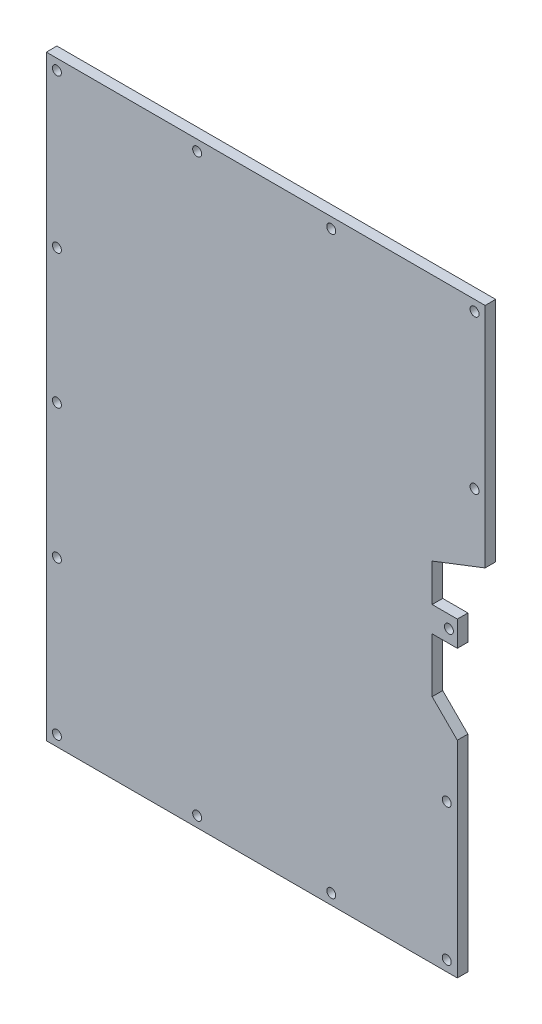
ISO-10303-21;
HEADER;
FILE_DESCRIPTION(('STEP AP214'),'2;1');
FILE_NAME('part.step','',(''),(''),'','','');
FILE_SCHEMA(('AUTOMOTIVE_DESIGN { 1 0 10303 214 1 1 1 1 }'));
ENDSEC;
DATA;
#1=APPLICATION_CONTEXT('core data for automotive mechanical design processes');
#2=APPLICATION_PROTOCOL_DEFINITION('international standard','automotive_design',2000,#1);
#3=PRODUCT_CONTEXT('',#1,'mechanical');
#4=PRODUCT('Part','Part','',(#3));
#5=PRODUCT_RELATED_PRODUCT_CATEGORY('part','',(#4));
#6=PRODUCT_DEFINITION_FORMATION('','',#4);
#7=PRODUCT_DEFINITION_CONTEXT('part definition',#1,'design');
#8=PRODUCT_DEFINITION('design','',#6,#7);
#9=PRODUCT_DEFINITION_SHAPE('','',#8);
#10=(LENGTH_UNIT() NAMED_UNIT(*) SI_UNIT(.MILLI.,.METRE.));
#11=(NAMED_UNIT(*) PLANE_ANGLE_UNIT() SI_UNIT($,.RADIAN.));
#12=(NAMED_UNIT(*) SI_UNIT($,.STERADIAN.) SOLID_ANGLE_UNIT());
#13=UNCERTAINTY_MEASURE_WITH_UNIT(LENGTH_MEASURE(1.E-05),#10,'distance_accuracy_value','');
#14=(GEOMETRIC_REPRESENTATION_CONTEXT(3) GLOBAL_UNCERTAINTY_ASSIGNED_CONTEXT((#13)) GLOBAL_UNIT_ASSIGNED_CONTEXT((#10,
#11,#12)) REPRESENTATION_CONTEXT('',''));
#15=CARTESIAN_POINT('',(0.,0.,0.));
#16=DIRECTION('',(0.,0.,1.));
#17=DIRECTION('',(1.,0.,0.));
#18=AXIS2_PLACEMENT_3D('',#15,#16,#17);
#19=CARTESIAN_POINT('',(-1.58749999999999,-56.4375,2.));
#20=DIRECTION('',(0.,0.,-1.));
#21=DIRECTION('',(-1.,0.,0.));
#22=AXIS2_PLACEMENT_3D('',#19,#20,#21);
#23=PLANE('',#22);
#24=CARTESIAN_POINT('',(-3.58749999999999,-28.51830741,2.));
#25=DIRECTION('',(0.,0.,1.));
#26=DIRECTION('',(1.,0.,0.));
#27=AXIS2_PLACEMENT_3D('',#24,#25,#26);
#28=CIRCLE('',#27,0.85);
#29=CARTESIAN_POINT('',(-2.73749999999999,-28.51830741,2.));
#30=VERTEX_POINT('',#29);
#31=EDGE_CURVE('E332',#30,#30,#28,.T.);
#32=ORIENTED_EDGE('',*,*,#31,.F.);
#33=EDGE_LOOP('',(#32));
#34=FACE_BOUND('',#33,.T.);
#35=CARTESIAN_POINT('',(-25.4438331206112,-54.4375,2.));
#36=DIRECTION('',(0.,0.,1.));
#37=DIRECTION('',(1.,0.,0.));
#38=AXIS2_PLACEMENT_3D('',#35,#36,#37);
#39=CIRCLE('',#38,0.850000000000001);
#40=CARTESIAN_POINT('',(-24.5938331206112,-54.4375,2.));
#41=VERTEX_POINT('',#40);
#42=EDGE_CURVE('E344',#41,#41,#39,.T.);
#43=ORIENTED_EDGE('',*,*,#42,.F.);
#44=EDGE_LOOP('',(#43));
#45=FACE_BOUND('',#44,.T.);
#46=CARTESIAN_POINT('',(-77.375,-54.4375,2.));
#47=DIRECTION('',(0.,0.,1.));
#48=DIRECTION('',(1.,0.,0.));
#49=AXIS2_PLACEMENT_3D('',#46,#47,#48);
#50=CIRCLE('',#49,0.850000000000007);
#51=CARTESIAN_POINT('',(-76.525,-54.4375,2.));
#52=VERTEX_POINT('',#51);
#53=EDGE_CURVE('E356',#52,#52,#50,.T.);
#54=ORIENTED_EDGE('',*,*,#53,.F.);
#55=EDGE_LOOP('',(#54));
#56=FACE_BOUND('',#55,.T.);
#57=CARTESIAN_POINT('',(-77.375,0.,2.));
#58=DIRECTION('',(0.,0.,1.));
#59=DIRECTION('',(1.,0.,0.));
#60=AXIS2_PLACEMENT_3D('',#57,#58,#59);
#61=CIRCLE('',#60,0.850000000000007);
#62=CARTESIAN_POINT('',(-76.525,0.,2.));
#63=VERTEX_POINT('',#62);
#64=EDGE_CURVE('E368',#63,#63,#61,.T.);
#65=ORIENTED_EDGE('',*,*,#64,.F.);
#66=EDGE_LOOP('',(#65));
#67=FACE_BOUND('',#66,.T.);
#68=CARTESIAN_POINT('',(-77.375,54.4375,2.));
#69=DIRECTION('',(0.,0.,1.));
#70=DIRECTION('',(1.,0.,0.));
#71=AXIS2_PLACEMENT_3D('',#68,#69,#70);
#72=CIRCLE('',#71,0.850000000000007);
#73=CARTESIAN_POINT('',(-76.525,54.4375,2.));
#74=VERTEX_POINT('',#73);
#75=EDGE_CURVE('E380',#74,#74,#72,.T.);
#76=ORIENTED_EDGE('',*,*,#75,.F.);
#77=EDGE_LOOP('',(#76));
#78=FACE_BOUND('',#77,.T.);
#79=CARTESIAN_POINT('',(-25.4438331206112,54.4375,2.));
#80=DIRECTION('',(0.,0.,1.));
#81=DIRECTION('',(1.,0.,0.));
#82=AXIS2_PLACEMENT_3D('',#79,#80,#81);
#83=CIRCLE('',#82,0.850000000000001);
#84=CARTESIAN_POINT('',(-24.5938331206112,54.4375,2.));
#85=VERTEX_POINT('',#84);
#86=EDGE_CURVE('E392',#85,#85,#83,.T.);
#87=ORIENTED_EDGE('',*,*,#86,.F.);
#88=EDGE_LOOP('',(#87));
#89=FACE_BOUND('',#88,.T.);
#90=CARTESIAN_POINT('',(-3.175,0.,2.));
#91=DIRECTION('',(0.,0.,1.));
#92=DIRECTION('',(1.,0.,0.));
#93=AXIS2_PLACEMENT_3D('',#90,#91,#92);
#94=CIRCLE('',#93,0.85);
#95=CARTESIAN_POINT('',(-2.325,0.,2.));
#96=VERTEX_POINT('',#95);
#97=EDGE_CURVE('E158',#96,#96,#94,.T.);
#98=ORIENTED_EDGE('',*,*,#97,.F.);
#99=EDGE_LOOP('',(#98));
#100=FACE_BOUND('',#99,.T.);
#101=DIRECTION('',(1.,0.,0.));
#102=VECTOR('',#101,1.);
#103=CARTESIAN_POINT('',(-79.375,-56.4375,2.));
#104=LINE('',#103,#102);
#105=CARTESIAN_POINT('',(-79.375,-56.4375,2.));
#106=VERTEX_POINT('',#105);
#107=CARTESIAN_POINT('',(-1.58749999999999,-56.4375,2.));
#108=VERTEX_POINT('',#107);
#109=EDGE_CURVE('E177',#106,#108,#104,.T.);
#110=ORIENTED_EDGE('',*,*,#109,.T.);
#111=DIRECTION('',(0.,1.,0.));
#112=VECTOR('',#111,1.);
#113=CARTESIAN_POINT('',(-1.58750000000002,-17.4624999999998,2.));
#114=LINE('',#113,#112);
#115=CARTESIAN_POINT('',(-1.58750000000002,-17.4624999999998,2.));
#116=VERTEX_POINT('',#115);
#117=EDGE_CURVE('E105',#108,#116,#114,.T.);
#118=ORIENTED_EDGE('',*,*,#117,.T.);
#119=DIRECTION('',(-0.707106781186561,0.707106781186534,0.));
#120=VECTOR('',#119,1.);
#121=CARTESIAN_POINT('',(-6.35,-12.7,2.));
#122=LINE('',#121,#120);
#123=CARTESIAN_POINT('',(-6.35,-12.7,2.));
#124=VERTEX_POINT('',#123);
#125=EDGE_CURVE('E204',#116,#124,#122,.T.);
#126=ORIENTED_EDGE('',*,*,#125,.T.);
#127=DIRECTION('',(0.,1.,0.));
#128=VECTOR('',#127,1.);
#129=CARTESIAN_POINT('',(-6.3499999999999,-2.4,2.));
#130=LINE('',#129,#128);
#131=CARTESIAN_POINT('',(-6.3499999999999,-2.4,2.));
#132=VERTEX_POINT('',#131);
#133=EDGE_CURVE('E223',#124,#132,#130,.T.);
#134=ORIENTED_EDGE('',*,*,#133,.T.);
#135=DIRECTION('',(1.,0.,0.));
#136=VECTOR('',#135,1.);
#137=CARTESIAN_POINT('',(-6.3499999999999,-2.4,2.));
#138=LINE('',#137,#136);
#139=CARTESIAN_POINT('',(-1.5875,-2.4,2.));
#140=VERTEX_POINT('',#139);
#141=EDGE_CURVE('E220',#132,#140,#138,.T.);
#142=ORIENTED_EDGE('',*,*,#141,.T.);
#143=DIRECTION('',(0.,1.,0.));
#144=VECTOR('',#143,1.);
#145=CARTESIAN_POINT('',(-1.5875,2.4,2.));
#146=LINE('',#145,#144);
#147=CARTESIAN_POINT('',(-1.5875,2.4,2.));
#148=VERTEX_POINT('',#147);
#149=EDGE_CURVE('E222',#140,#148,#146,.T.);
#150=ORIENTED_EDGE('',*,*,#149,.T.);
#151=DIRECTION('',(-1.,0.,0.));
#152=VECTOR('',#151,1.);
#153=CARTESIAN_POINT('',(-6.3499999999999,2.4,2.));
#154=LINE('',#153,#152);
#155=CARTESIAN_POINT('',(-6.3499999999999,2.4,2.));
#156=VERTEX_POINT('',#155);
#157=EDGE_CURVE('E225',#148,#156,#154,.T.);
#158=ORIENTED_EDGE('',*,*,#157,.T.);
#159=DIRECTION('',(0.,1.,0.));
#160=VECTOR('',#159,1.);
#161=CARTESIAN_POINT('',(-6.3499999999999,2.4,2.));
#162=LINE('',#161,#160);
#163=CARTESIAN_POINT('',(-6.35,9.525,2.));
#164=VERTEX_POINT('',#163);
#165=EDGE_CURVE('E231',#156,#164,#162,.T.);
#166=ORIENTED_EDGE('',*,*,#165,.T.);
#167=DIRECTION('',(0.932581413236618,0.360959703686702,0.));
#168=VECTOR('',#167,1.);
#169=CARTESIAN_POINT('',(-6.35,9.525,2.));
#170=LINE('',#169,#168);
#171=CARTESIAN_POINT('',(3.675,13.4052199766135,2.));
#172=VERTEX_POINT('',#171);
#173=EDGE_CURVE('E136',#164,#172,#170,.T.);
#174=ORIENTED_EDGE('',*,*,#173,.T.);
#175=DIRECTION('',(0.,1.,0.));
#176=VECTOR('',#175,1.);
#177=CARTESIAN_POINT('',(3.675,13.4052199766135,2.));
#178=LINE('',#177,#176);
#179=CARTESIAN_POINT('',(3.675,56.4375,2.));
#180=VERTEX_POINT('',#179);
#181=EDGE_CURVE('E130',#172,#180,#178,.T.);
#182=ORIENTED_EDGE('',*,*,#181,.T.);
#183=DIRECTION('',(-1.,0.,0.));
#184=VECTOR('',#183,1.);
#185=CARTESIAN_POINT('',(-79.375,56.4375,2.));
#186=LINE('',#185,#184);
#187=CARTESIAN_POINT('',(-79.375,56.4375,2.));
#188=VERTEX_POINT('',#187);
#189=EDGE_CURVE('E134',#180,#188,#186,.T.);
#190=ORIENTED_EDGE('',*,*,#189,.T.);
#191=DIRECTION('',(0.,-1.,0.));
#192=VECTOR('',#191,1.);
#193=CARTESIAN_POINT('',(-79.375,-56.4375,2.));
#194=LINE('',#193,#192);
#195=EDGE_CURVE('E50',#188,#106,#194,.T.);
#196=ORIENTED_EDGE('',*,*,#195,.T.);
#197=EDGE_LOOP('',(#110,#118,#126,#134,#142,#150,#158,#166,#174,#182,#190,#196));
#198=FACE_BOUND('',#197,.T.);
#199=CARTESIAN_POINT('',(1.675,54.4375,2.));
#200=DIRECTION('',(0.,0.,1.));
#201=DIRECTION('',(1.,0.,0.));
#202=AXIS2_PLACEMENT_3D('',#199,#200,#201);
#203=CIRCLE('',#202,0.850000000000001);
#204=CARTESIAN_POINT('',(2.525,54.4375,2.));
#205=VERTEX_POINT('',#204);
#206=EDGE_CURVE('E398',#205,#205,#203,.T.);
#207=ORIENTED_EDGE('',*,*,#206,.F.);
#208=EDGE_LOOP('',(#207));
#209=FACE_BOUND('',#208,.T.);
#210=CARTESIAN_POINT('',(-50.8290630224962,54.4375,2.));
#211=DIRECTION('',(0.,0.,1.));
#212=DIRECTION('',(1.,0.,0.));
#213=AXIS2_PLACEMENT_3D('',#210,#211,#212);
#214=CIRCLE('',#213,0.849999999999999);
#215=CARTESIAN_POINT('',(-49.9790630224962,54.4375,2.));
#216=VERTEX_POINT('',#215);
#217=EDGE_CURVE('E386',#216,#216,#214,.T.);
#218=ORIENTED_EDGE('',*,*,#217,.F.);
#219=EDGE_LOOP('',(#218));
#220=FACE_BOUND('',#219,.T.);
#221=CARTESIAN_POINT('',(-77.375,25.3864376457254,2.));
#222=DIRECTION('',(0.,0.,1.));
#223=DIRECTION('',(1.,0.,0.));
#224=AXIS2_PLACEMENT_3D('',#221,#222,#223);
#225=CIRCLE('',#224,0.850000000000006);
#226=CARTESIAN_POINT('',(-76.525,25.3864376457254,2.));
#227=VERTEX_POINT('',#226);
#228=EDGE_CURVE('E374',#227,#227,#225,.T.);
#229=ORIENTED_EDGE('',*,*,#228,.F.);
#230=EDGE_LOOP('',(#229));
#231=FACE_BOUND('',#230,.T.);
#232=CARTESIAN_POINT('',(-77.375,-25.4084412166099,2.));
#233=DIRECTION('',(0.,0.,1.));
#234=DIRECTION('',(1.,0.,0.));
#235=AXIS2_PLACEMENT_3D('',#232,#233,#234);
#236=CIRCLE('',#235,0.850000000000006);
#237=CARTESIAN_POINT('',(-76.525,-25.4084412166099,2.));
#238=VERTEX_POINT('',#237);
#239=EDGE_CURVE('E362',#238,#238,#236,.T.);
#240=ORIENTED_EDGE('',*,*,#239,.F.);
#241=EDGE_LOOP('',(#240));
#242=FACE_BOUND('',#241,.T.);
#243=CARTESIAN_POINT('',(-50.8290630224962,-54.4375,2.));
#244=DIRECTION('',(0.,0.,1.));
#245=DIRECTION('',(1.,0.,0.));
#246=AXIS2_PLACEMENT_3D('',#243,#244,#245);
#247=CIRCLE('',#246,0.849999999999999);
#248=CARTESIAN_POINT('',(-49.9790630224962,-54.4375,2.));
#249=VERTEX_POINT('',#248);
#250=EDGE_CURVE('E350',#249,#249,#247,.T.);
#251=ORIENTED_EDGE('',*,*,#250,.F.);
#252=EDGE_LOOP('',(#251));
#253=FACE_BOUND('',#252,.T.);
#254=CARTESIAN_POINT('',(-3.58749999999999,-54.4375,2.));
#255=DIRECTION('',(0.,0.,1.));
#256=DIRECTION('',(1.,0.,0.));
#257=AXIS2_PLACEMENT_3D('',#254,#255,#256);
#258=CIRCLE('',#257,0.850000000000003);
#259=CARTESIAN_POINT('',(-2.73749999999999,-54.4375,2.));
#260=VERTEX_POINT('',#259);
#261=EDGE_CURVE('E338',#260,#260,#258,.T.);
#262=ORIENTED_EDGE('',*,*,#261,.F.);
#263=EDGE_LOOP('',(#262));
#264=FACE_BOUND('',#263,.T.);
#265=CARTESIAN_POINT('',(1.675,25.3864376457254,2.));
#266=DIRECTION('',(0.,0.,1.));
#267=DIRECTION('',(1.,0.,0.));
#268=AXIS2_PLACEMENT_3D('',#265,#266,#267);
#269=CIRCLE('',#268,0.85);
#270=CARTESIAN_POINT('',(2.525,25.3864376457254,2.));
#271=VERTEX_POINT('',#270);
#272=EDGE_CURVE('E323',#271,#271,#269,.T.);
#273=ORIENTED_EDGE('',*,*,#272,.F.);
#274=EDGE_LOOP('',(#273));
#275=FACE_BOUND('',#274,.T.);
#276=ADVANCED_FACE('F33',(#34,#45,#56,#67,#78,#89,#100,#198,#209,#220,#231,#242,#253,#264,#275),
#23,.F.);
#277=CARTESIAN_POINT('',(-1.58749999999999,-56.4375,0.));
#278=DIRECTION('',(0.,0.,-1.));
#279=DIRECTION('',(-1.,0.,0.));
#280=AXIS2_PLACEMENT_3D('',#277,#278,#279);
#281=PLANE('',#280);
#282=CARTESIAN_POINT('',(-3.58749999999999,-28.51830741,0.));
#283=DIRECTION('',(0.,0.,1.));
#284=DIRECTION('',(1.,0.,0.));
#285=AXIS2_PLACEMENT_3D('',#282,#283,#284);
#286=CIRCLE('',#285,0.85);
#287=CARTESIAN_POINT('',(-2.73749999999999,-28.51830741,0.));
#288=VERTEX_POINT('',#287);
#289=EDGE_CURVE('E329',#288,#288,#286,.T.);
#290=ORIENTED_EDGE('',*,*,#289,.T.);
#291=EDGE_LOOP('',(#290));
#292=FACE_BOUND('',#291,.T.);
#293=CARTESIAN_POINT('',(-25.4438331206112,-54.4375,0.));
#294=DIRECTION('',(0.,0.,1.));
#295=DIRECTION('',(1.,0.,0.));
#296=AXIS2_PLACEMENT_3D('',#293,#294,#295);
#297=CIRCLE('',#296,0.850000000000001);
#298=CARTESIAN_POINT('',(-24.5938331206112,-54.4375,0.));
#299=VERTEX_POINT('',#298);
#300=EDGE_CURVE('E341',#299,#299,#297,.T.);
#301=ORIENTED_EDGE('',*,*,#300,.T.);
#302=EDGE_LOOP('',(#301));
#303=FACE_BOUND('',#302,.T.);
#304=CARTESIAN_POINT('',(-77.375,-54.4375,0.));
#305=DIRECTION('',(0.,0.,1.));
#306=DIRECTION('',(1.,0.,0.));
#307=AXIS2_PLACEMENT_3D('',#304,#305,#306);
#308=CIRCLE('',#307,0.850000000000007);
#309=CARTESIAN_POINT('',(-76.525,-54.4375,0.));
#310=VERTEX_POINT('',#309);
#311=EDGE_CURVE('E353',#310,#310,#308,.T.);
#312=ORIENTED_EDGE('',*,*,#311,.T.);
#313=EDGE_LOOP('',(#312));
#314=FACE_BOUND('',#313,.T.);
#315=CARTESIAN_POINT('',(-77.375,0.,0.));
#316=DIRECTION('',(0.,0.,1.));
#317=DIRECTION('',(1.,0.,0.));
#318=AXIS2_PLACEMENT_3D('',#315,#316,#317);
#319=CIRCLE('',#318,0.850000000000007);
#320=CARTESIAN_POINT('',(-76.525,0.,0.));
#321=VERTEX_POINT('',#320);
#322=EDGE_CURVE('E365',#321,#321,#319,.T.);
#323=ORIENTED_EDGE('',*,*,#322,.T.);
#324=EDGE_LOOP('',(#323));
#325=FACE_BOUND('',#324,.T.);
#326=CARTESIAN_POINT('',(-77.375,54.4375,0.));
#327=DIRECTION('',(0.,0.,1.));
#328=DIRECTION('',(1.,0.,0.));
#329=AXIS2_PLACEMENT_3D('',#326,#327,#328);
#330=CIRCLE('',#329,0.850000000000007);
#331=CARTESIAN_POINT('',(-76.525,54.4375,0.));
#332=VERTEX_POINT('',#331);
#333=EDGE_CURVE('E377',#332,#332,#330,.T.);
#334=ORIENTED_EDGE('',*,*,#333,.T.);
#335=EDGE_LOOP('',(#334));
#336=FACE_BOUND('',#335,.T.);
#337=CARTESIAN_POINT('',(-25.4438331206112,54.4375,0.));
#338=DIRECTION('',(0.,0.,1.));
#339=DIRECTION('',(1.,0.,0.));
#340=AXIS2_PLACEMENT_3D('',#337,#338,#339);
#341=CIRCLE('',#340,0.850000000000001);
#342=CARTESIAN_POINT('',(-24.5938331206112,54.4375,0.));
#343=VERTEX_POINT('',#342);
#344=EDGE_CURVE('E389',#343,#343,#341,.T.);
#345=ORIENTED_EDGE('',*,*,#344,.T.);
#346=EDGE_LOOP('',(#345));
#347=FACE_BOUND('',#346,.T.);
#348=CARTESIAN_POINT('',(-3.175,0.,0.));
#349=DIRECTION('',(0.,0.,1.));
#350=DIRECTION('',(1.,0.,0.));
#351=AXIS2_PLACEMENT_3D('',#348,#349,#350);
#352=CIRCLE('',#351,0.85);
#353=CARTESIAN_POINT('',(-2.325,0.,0.));
#354=VERTEX_POINT('',#353);
#355=EDGE_CURVE('E401',#354,#354,#352,.T.);
#356=ORIENTED_EDGE('',*,*,#355,.T.);
#357=EDGE_LOOP('',(#356));
#358=FACE_BOUND('',#357,.T.);
#359=DIRECTION('',(1.,0.,0.));
#360=VECTOR('',#359,1.);
#361=CARTESIAN_POINT('',(-79.375,-56.4375,0.));
#362=LINE('',#361,#360);
#363=CARTESIAN_POINT('',(-79.375,-56.4375,0.));
#364=VERTEX_POINT('',#363);
#365=CARTESIAN_POINT('',(-1.58749999999999,-56.4375,0.));
#366=VERTEX_POINT('',#365);
#367=EDGE_CURVE('E154',#364,#366,#362,.T.);
#368=ORIENTED_EDGE('',*,*,#367,.F.);
#369=DIRECTION('',(0.,-1.,0.));
#370=VECTOR('',#369,1.);
#371=CARTESIAN_POINT('',(-79.375,-56.4375,0.));
#372=LINE('',#371,#370);
#373=CARTESIAN_POINT('',(-79.375,56.4375,0.));
#374=VERTEX_POINT('',#373);
#375=EDGE_CURVE('E97',#374,#364,#372,.T.);
#376=ORIENTED_EDGE('',*,*,#375,.F.);
#377=DIRECTION('',(-1.,0.,0.));
#378=VECTOR('',#377,1.);
#379=CARTESIAN_POINT('',(-79.375,56.4375,0.));
#380=LINE('',#379,#378);
#381=CARTESIAN_POINT('',(3.675,56.4375,0.));
#382=VERTEX_POINT('',#381);
#383=EDGE_CURVE('E91',#382,#374,#380,.T.);
#384=ORIENTED_EDGE('',*,*,#383,.F.);
#385=DIRECTION('',(0.,1.,0.));
#386=VECTOR('',#385,1.);
#387=CARTESIAN_POINT('',(3.675,13.4052199766135,0.));
#388=LINE('',#387,#386);
#389=CARTESIAN_POINT('',(3.675,13.4052199766135,0.));
#390=VERTEX_POINT('',#389);
#391=EDGE_CURVE('E144',#390,#382,#388,.T.);
#392=ORIENTED_EDGE('',*,*,#391,.F.);
#393=DIRECTION('',(0.932581413236618,0.360959703686702,0.));
#394=VECTOR('',#393,1.);
#395=CARTESIAN_POINT('',(-6.35,9.525,0.));
#396=LINE('',#395,#394);
#397=CARTESIAN_POINT('',(-6.35,9.525,0.));
#398=VERTEX_POINT('',#397);
#399=EDGE_CURVE('E172',#398,#390,#396,.T.);
#400=ORIENTED_EDGE('',*,*,#399,.F.);
#401=DIRECTION('',(0.,1.,0.));
#402=VECTOR('',#401,1.);
#403=CARTESIAN_POINT('',(-6.3499999999999,2.4,0.));
#404=LINE('',#403,#402);
#405=CARTESIAN_POINT('',(-6.3499999999999,2.4,0.));
#406=VERTEX_POINT('',#405);
#407=EDGE_CURVE('E170',#406,#398,#404,.T.);
#408=ORIENTED_EDGE('',*,*,#407,.F.);
#409=DIRECTION('',(-1.,0.,0.));
#410=VECTOR('',#409,1.);
#411=CARTESIAN_POINT('',(-6.3499999999999,2.4,0.));
#412=LINE('',#411,#410);
#413=CARTESIAN_POINT('',(-1.5875,2.4,0.));
#414=VERTEX_POINT('',#413);
#415=EDGE_CURVE('E168',#414,#406,#412,.T.);
#416=ORIENTED_EDGE('',*,*,#415,.F.);
#417=DIRECTION('',(0.,1.,0.));
#418=VECTOR('',#417,1.);
#419=CARTESIAN_POINT('',(-1.5875,2.4,0.));
#420=LINE('',#419,#418);
#421=CARTESIAN_POINT('',(-1.5875,-2.4,0.));
#422=VERTEX_POINT('',#421);
#423=EDGE_CURVE('E166',#422,#414,#420,.T.);
#424=ORIENTED_EDGE('',*,*,#423,.F.);
#425=DIRECTION('',(1.,0.,0.));
#426=VECTOR('',#425,1.);
#427=CARTESIAN_POINT('',(-6.3499999999999,-2.4,0.));
#428=LINE('',#427,#426);
#429=CARTESIAN_POINT('',(-6.3499999999999,-2.4,0.));
#430=VERTEX_POINT('',#429);
#431=EDGE_CURVE('E164',#430,#422,#428,.T.);
#432=ORIENTED_EDGE('',*,*,#431,.F.);
#433=DIRECTION('',(0.,1.,0.));
#434=VECTOR('',#433,1.);
#435=CARTESIAN_POINT('',(-6.3499999999999,-2.4,0.));
#436=LINE('',#435,#434);
#437=CARTESIAN_POINT('',(-6.35,-12.7,0.));
#438=VERTEX_POINT('',#437);
#439=EDGE_CURVE('E162',#438,#430,#436,.T.);
#440=ORIENTED_EDGE('',*,*,#439,.F.);
#441=DIRECTION('',(-0.707106781186561,0.707106781186534,0.));
#442=VECTOR('',#441,1.);
#443=CARTESIAN_POINT('',(-6.35,-12.7,0.));
#444=LINE('',#443,#442);
#445=CARTESIAN_POINT('',(-1.58750000000002,-17.4624999999998,0.));
#446=VERTEX_POINT('',#445);
#447=EDGE_CURVE('E160',#446,#438,#444,.T.);
#448=ORIENTED_EDGE('',*,*,#447,.F.);
#449=DIRECTION('',(0.,1.,0.));
#450=VECTOR('',#449,1.);
#451=CARTESIAN_POINT('',(-1.58750000000002,-17.4624999999998,0.));
#452=LINE('',#451,#450);
#453=EDGE_CURVE('E157',#366,#446,#452,.T.);
#454=ORIENTED_EDGE('',*,*,#453,.F.);
#455=EDGE_LOOP('',(#368,#376,#384,#392,#400,#408,#416,#424,#432,#440,#448,#454));
#456=FACE_BOUND('',#455,.T.);
#457=CARTESIAN_POINT('',(1.675,54.4375,0.));
#458=DIRECTION('',(0.,0.,1.));
#459=DIRECTION('',(1.,0.,0.));
#460=AXIS2_PLACEMENT_3D('',#457,#458,#459);
#461=CIRCLE('',#460,0.850000000000001);
#462=CARTESIAN_POINT('',(2.525,54.4375,0.));
#463=VERTEX_POINT('',#462);
#464=EDGE_CURVE('E395',#463,#463,#461,.T.);
#465=ORIENTED_EDGE('',*,*,#464,.T.);
#466=EDGE_LOOP('',(#465));
#467=FACE_BOUND('',#466,.T.);
#468=CARTESIAN_POINT('',(-50.8290630224962,54.4375,0.));
#469=DIRECTION('',(0.,0.,1.));
#470=DIRECTION('',(1.,0.,0.));
#471=AXIS2_PLACEMENT_3D('',#468,#469,#470);
#472=CIRCLE('',#471,0.849999999999999);
#473=CARTESIAN_POINT('',(-49.9790630224962,54.4375,0.));
#474=VERTEX_POINT('',#473);
#475=EDGE_CURVE('E383',#474,#474,#472,.T.);
#476=ORIENTED_EDGE('',*,*,#475,.T.);
#477=EDGE_LOOP('',(#476));
#478=FACE_BOUND('',#477,.T.);
#479=CARTESIAN_POINT('',(-77.375,25.3864376457254,0.));
#480=DIRECTION('',(0.,0.,1.));
#481=DIRECTION('',(1.,0.,0.));
#482=AXIS2_PLACEMENT_3D('',#479,#480,#481);
#483=CIRCLE('',#482,0.850000000000006);
#484=CARTESIAN_POINT('',(-76.525,25.3864376457254,0.));
#485=VERTEX_POINT('',#484);
#486=EDGE_CURVE('E371',#485,#485,#483,.T.);
#487=ORIENTED_EDGE('',*,*,#486,.T.);
#488=EDGE_LOOP('',(#487));
#489=FACE_BOUND('',#488,.T.);
#490=CARTESIAN_POINT('',(-77.375,-25.4084412166099,0.));
#491=DIRECTION('',(0.,0.,1.));
#492=DIRECTION('',(1.,0.,0.));
#493=AXIS2_PLACEMENT_3D('',#490,#491,#492);
#494=CIRCLE('',#493,0.850000000000006);
#495=CARTESIAN_POINT('',(-76.525,-25.4084412166099,0.));
#496=VERTEX_POINT('',#495);
#497=EDGE_CURVE('E359',#496,#496,#494,.T.);
#498=ORIENTED_EDGE('',*,*,#497,.T.);
#499=EDGE_LOOP('',(#498));
#500=FACE_BOUND('',#499,.T.);
#501=CARTESIAN_POINT('',(-50.8290630224962,-54.4375,0.));
#502=DIRECTION('',(0.,0.,1.));
#503=DIRECTION('',(1.,0.,0.));
#504=AXIS2_PLACEMENT_3D('',#501,#502,#503);
#505=CIRCLE('',#504,0.849999999999999);
#506=CARTESIAN_POINT('',(-49.9790630224962,-54.4375,0.));
#507=VERTEX_POINT('',#506);
#508=EDGE_CURVE('E347',#507,#507,#505,.T.);
#509=ORIENTED_EDGE('',*,*,#508,.T.);
#510=EDGE_LOOP('',(#509));
#511=FACE_BOUND('',#510,.T.);
#512=CARTESIAN_POINT('',(-3.58749999999999,-54.4375,0.));
#513=DIRECTION('',(0.,0.,1.));
#514=DIRECTION('',(1.,0.,0.));
#515=AXIS2_PLACEMENT_3D('',#512,#513,#514);
#516=CIRCLE('',#515,0.850000000000003);
#517=CARTESIAN_POINT('',(-2.73749999999999,-54.4375,0.));
#518=VERTEX_POINT('',#517);
#519=EDGE_CURVE('E335',#518,#518,#516,.T.);
#520=ORIENTED_EDGE('',*,*,#519,.T.);
#521=EDGE_LOOP('',(#520));
#522=FACE_BOUND('',#521,.T.);
#523=CARTESIAN_POINT('',(1.675,25.3864376457254,0.));
#524=DIRECTION('',(0.,0.,1.));
#525=DIRECTION('',(1.,0.,0.));
#526=AXIS2_PLACEMENT_3D('',#523,#524,#525);
#527=CIRCLE('',#526,0.85);
#528=CARTESIAN_POINT('',(2.525,25.3864376457254,0.));
#529=VERTEX_POINT('',#528);
#530=EDGE_CURVE('E326',#529,#529,#527,.T.);
#531=ORIENTED_EDGE('',*,*,#530,.T.);
#532=EDGE_LOOP('',(#531));
#533=FACE_BOUND('',#532,.T.);
#534=ADVANCED_FACE('F208',(#292,#303,#314,#325,#336,#347,#358,#456,#467,#478,#489,#500,#511,
#522,#533),#281,.T.);
#535=CARTESIAN_POINT('',(-79.375,-56.4375,2.));
#536=DIRECTION('',(0.,1.,0.));
#537=DIRECTION('',(-1.,0.,0.));
#538=AXIS2_PLACEMENT_3D('',#535,#536,#537);
#539=PLANE('',#538);
#540=ORIENTED_EDGE('',*,*,#367,.T.);
#541=DIRECTION('',(0.,0.,-1.));
#542=VECTOR('',#541,1.);
#543=CARTESIAN_POINT('',(-1.58749999999999,-56.4375,2.));
#544=LINE('',#543,#542);
#545=EDGE_CURVE('E11',#108,#366,#544,.T.);
#546=ORIENTED_EDGE('',*,*,#545,.F.);
#547=ORIENTED_EDGE('',*,*,#109,.F.);
#548=DIRECTION('',(0.,0.,-1.));
#549=VECTOR('',#548,1.);
#550=CARTESIAN_POINT('',(-79.375,-56.4375,2.));
#551=LINE('',#550,#549);
#552=EDGE_CURVE('E150',#106,#364,#551,.T.);
#553=ORIENTED_EDGE('',*,*,#552,.T.);
#554=EDGE_LOOP('',(#540,#546,#547,#553));
#555=FACE_BOUND('',#554,.T.);
#556=ADVANCED_FACE('F35',(#555),#539,.F.);
#557=CARTESIAN_POINT('',(-1.58750000000002,-17.4624999999998,2.));
#558=DIRECTION('',(-1.,0.,0.));
#559=DIRECTION('',(0.,-1.,0.));
#560=AXIS2_PLACEMENT_3D('',#557,#558,#559);
#561=PLANE('',#560);
#562=ORIENTED_EDGE('',*,*,#453,.T.);
#563=DIRECTION('',(0.,0.,-1.));
#564=VECTOR('',#563,1.);
#565=CARTESIAN_POINT('',(-1.58750000000002,-17.4624999999998,2.));
#566=LINE('',#565,#564);
#567=EDGE_CURVE('E42',#116,#446,#566,.T.);
#568=ORIENTED_EDGE('',*,*,#567,.F.);
#569=ORIENTED_EDGE('',*,*,#117,.F.);
#570=ORIENTED_EDGE('',*,*,#545,.T.);
#571=EDGE_LOOP('',(#562,#568,#569,#570));
#572=FACE_BOUND('',#571,.T.);
#573=ADVANCED_FACE('F600',(#572),#561,.F.);
#574=CARTESIAN_POINT('',(-6.35,-12.7,2.));
#575=DIRECTION('',(-0.707106781186534,-0.707106781186561,0.));
#576=DIRECTION('',(0.707106781186561,-0.707106781186534,0.));
#577=AXIS2_PLACEMENT_3D('',#574,#575,#576);
#578=PLANE('',#577);
#579=ORIENTED_EDGE('',*,*,#447,.T.);
#580=DIRECTION('',(0.,0.,-1.));
#581=VECTOR('',#580,1.);
#582=CARTESIAN_POINT('',(-6.35,-12.7,2.));
#583=LINE('',#582,#581);
#584=EDGE_CURVE('E196',#124,#438,#583,.T.);
#585=ORIENTED_EDGE('',*,*,#584,.F.);
#586=ORIENTED_EDGE('',*,*,#125,.F.);
#587=ORIENTED_EDGE('',*,*,#567,.T.);
#588=EDGE_LOOP('',(#579,#585,#586,#587));
#589=FACE_BOUND('',#588,.T.);
#590=ADVANCED_FACE('F202',(#589),#578,.F.);
#591=CARTESIAN_POINT('',(-6.3499999999999,-2.4,2.));
#592=DIRECTION('',(-1.,0.,0.));
#593=DIRECTION('',(0.,-1.,0.));
#594=AXIS2_PLACEMENT_3D('',#591,#592,#593);
#595=PLANE('',#594);
#596=ORIENTED_EDGE('',*,*,#439,.T.);
#597=DIRECTION('',(0.,0.,-1.));
#598=VECTOR('',#597,1.);
#599=CARTESIAN_POINT('',(-6.3499999999999,-2.4,2.));
#600=LINE('',#599,#598);
#601=EDGE_CURVE('E193',#132,#430,#600,.T.);
#602=ORIENTED_EDGE('',*,*,#601,.F.);
#603=ORIENTED_EDGE('',*,*,#133,.F.);
#604=ORIENTED_EDGE('',*,*,#584,.T.);
#605=EDGE_LOOP('',(#596,#602,#603,#604));
#606=FACE_BOUND('',#605,.T.);
#607=ADVANCED_FACE('F214',(#606),#595,.F.);
#608=CARTESIAN_POINT('',(-6.3499999999999,-2.4,2.));
#609=DIRECTION('',(0.,1.,0.));
#610=DIRECTION('',(-1.,0.,0.));
#611=AXIS2_PLACEMENT_3D('',#608,#609,#610);
#612=PLANE('',#611);
#613=ORIENTED_EDGE('',*,*,#431,.T.);
#614=DIRECTION('',(0.,0.,-1.));
#615=VECTOR('',#614,1.);
#616=CARTESIAN_POINT('',(-1.5875,-2.4,2.));
#617=LINE('',#616,#615);
#618=EDGE_CURVE('E190',#140,#422,#617,.T.);
#619=ORIENTED_EDGE('',*,*,#618,.F.);
#620=ORIENTED_EDGE('',*,*,#141,.F.);
#621=ORIENTED_EDGE('',*,*,#601,.T.);
#622=EDGE_LOOP('',(#613,#619,#620,#621));
#623=FACE_BOUND('',#622,.T.);
#624=ADVANCED_FACE('F218',(#623),#612,.F.);
#625=CARTESIAN_POINT('',(-1.5875,2.4,2.));
#626=DIRECTION('',(-1.,0.,0.));
#627=DIRECTION('',(0.,-1.,0.));
#628=AXIS2_PLACEMENT_3D('',#625,#626,#627);
#629=PLANE('',#628);
#630=ORIENTED_EDGE('',*,*,#423,.T.);
#631=DIRECTION('',(0.,0.,-1.));
#632=VECTOR('',#631,1.);
#633=CARTESIAN_POINT('',(-1.5875,2.4,2.));
#634=LINE('',#633,#632);
#635=EDGE_CURVE('E187',#148,#414,#634,.T.);
#636=ORIENTED_EDGE('',*,*,#635,.F.);
#637=ORIENTED_EDGE('',*,*,#149,.F.);
#638=ORIENTED_EDGE('',*,*,#618,.T.);
#639=EDGE_LOOP('',(#630,#636,#637,#638));
#640=FACE_BOUND('',#639,.T.);
#641=ADVANCED_FACE('F565',(#640),#629,.F.);
#642=CARTESIAN_POINT('',(-6.3499999999999,2.4,2.));
#643=DIRECTION('',(0.,-1.,0.));
#644=DIRECTION('',(0.,0.,-1.));
#645=AXIS2_PLACEMENT_3D('',#642,#643,#644);
#646=PLANE('',#645);
#647=ORIENTED_EDGE('',*,*,#415,.T.);
#648=DIRECTION('',(0.,0.,-1.));
#649=VECTOR('',#648,1.);
#650=CARTESIAN_POINT('',(-6.3499999999999,2.4,2.));
#651=LINE('',#650,#649);
#652=EDGE_CURVE('E184',#156,#406,#651,.T.);
#653=ORIENTED_EDGE('',*,*,#652,.F.);
#654=ORIENTED_EDGE('',*,*,#157,.F.);
#655=ORIENTED_EDGE('',*,*,#635,.T.);
#656=EDGE_LOOP('',(#647,#653,#654,#655));
#657=FACE_BOUND('',#656,.T.);
#658=ADVANCED_FACE('F556',(#657),#646,.F.);
#659=CARTESIAN_POINT('',(-6.3499999999999,2.4,2.));
#660=DIRECTION('',(-1.,0.,0.));
#661=DIRECTION('',(0.,-1.,0.));
#662=AXIS2_PLACEMENT_3D('',#659,#660,#661);
#663=PLANE('',#662);
#664=ORIENTED_EDGE('',*,*,#407,.T.);
#665=DIRECTION('',(0.,0.,-1.));
#666=VECTOR('',#665,1.);
#667=CARTESIAN_POINT('',(-6.35,9.525,2.));
#668=LINE('',#667,#666);
#669=EDGE_CURVE('E181',#164,#398,#668,.T.);
#670=ORIENTED_EDGE('',*,*,#669,.F.);
#671=ORIENTED_EDGE('',*,*,#165,.F.);
#672=ORIENTED_EDGE('',*,*,#652,.T.);
#673=EDGE_LOOP('',(#664,#670,#671,#672));
#674=FACE_BOUND('',#673,.T.);
#675=ADVANCED_FACE('F237',(#674),#663,.F.);
#676=CARTESIAN_POINT('',(-6.35,9.525,2.));
#677=DIRECTION('',(-0.360959703686702,0.932581413236618,0.));
#678=DIRECTION('',(-0.932581413236618,-0.360959703686702,0.));
#679=AXIS2_PLACEMENT_3D('',#676,#677,#678);
#680=PLANE('',#679);
#681=ORIENTED_EDGE('',*,*,#399,.T.);
#682=DIRECTION('',(0.,0.,-1.));
#683=VECTOR('',#682,1.);
#684=CARTESIAN_POINT('',(3.675,13.4052199766135,2.));
#685=LINE('',#684,#683);
#686=EDGE_CURVE('E145',#172,#390,#685,.T.);
#687=ORIENTED_EDGE('',*,*,#686,.F.);
#688=ORIENTED_EDGE('',*,*,#173,.F.);
#689=ORIENTED_EDGE('',*,*,#669,.T.);
#690=EDGE_LOOP('',(#681,#687,#688,#689));
#691=FACE_BOUND('',#690,.T.);
#692=ADVANCED_FACE('F241',(#691),#680,.F.);
#693=CARTESIAN_POINT('',(3.675,13.4052199766135,2.));
#694=DIRECTION('',(-1.,0.,0.));
#695=DIRECTION('',(0.,-1.,0.));
#696=AXIS2_PLACEMENT_3D('',#693,#694,#695);
#697=PLANE('',#696);
#698=ORIENTED_EDGE('',*,*,#391,.T.);
#699=DIRECTION('',(0.,0.,-1.));
#700=VECTOR('',#699,1.);
#701=CARTESIAN_POINT('',(3.675,56.4375,2.));
#702=LINE('',#701,#700);
#703=EDGE_CURVE('E141',#180,#382,#702,.T.);
#704=ORIENTED_EDGE('',*,*,#703,.F.);
#705=ORIENTED_EDGE('',*,*,#181,.F.);
#706=ORIENTED_EDGE('',*,*,#686,.T.);
#707=EDGE_LOOP('',(#698,#704,#705,#706));
#708=FACE_BOUND('',#707,.T.);
#709=ADVANCED_FACE('F142',(#708),#697,.F.);
#710=CARTESIAN_POINT('',(-79.375,56.4375,2.));
#711=DIRECTION('',(0.,-1.,0.));
#712=DIRECTION('',(0.,0.,-1.));
#713=AXIS2_PLACEMENT_3D('',#710,#711,#712);
#714=PLANE('',#713);
#715=ORIENTED_EDGE('',*,*,#383,.T.);
#716=DIRECTION('',(0.,0.,-1.));
#717=VECTOR('',#716,1.);
#718=CARTESIAN_POINT('',(-79.375,56.4375,2.));
#719=LINE('',#718,#717);
#720=EDGE_CURVE('E146',#188,#374,#719,.T.);
#721=ORIENTED_EDGE('',*,*,#720,.F.);
#722=ORIENTED_EDGE('',*,*,#189,.F.);
#723=ORIENTED_EDGE('',*,*,#703,.T.);
#724=EDGE_LOOP('',(#715,#721,#722,#723));
#725=FACE_BOUND('',#724,.T.);
#726=ADVANCED_FACE('F148',(#725),#714,.F.);
#727=CARTESIAN_POINT('',(-79.375,-56.4375,2.));
#728=DIRECTION('',(1.,0.,0.));
#729=DIRECTION('',(0.,1.,0.));
#730=AXIS2_PLACEMENT_3D('',#727,#728,#729);
#731=PLANE('',#730);
#732=ORIENTED_EDGE('',*,*,#375,.T.);
#733=ORIENTED_EDGE('',*,*,#552,.F.);
#734=ORIENTED_EDGE('',*,*,#195,.F.);
#735=ORIENTED_EDGE('',*,*,#720,.T.);
#736=EDGE_LOOP('',(#732,#733,#734,#735));
#737=FACE_BOUND('',#736,.T.);
#738=ADVANCED_FACE('F245',(#737),#731,.F.);
#739=CARTESIAN_POINT('',(-3.175,0.,2.));
#740=DIRECTION('',(0.,0.,-1.));
#741=DIRECTION('',(-1.,0.,0.));
#742=AXIS2_PLACEMENT_3D('',#739,#740,#741);
#743=CYLINDRICAL_SURFACE('',#742,0.85);
#744=ORIENTED_EDGE('',*,*,#97,.T.);
#745=EDGE_LOOP('',(#744));
#746=FACE_BOUND('',#745,.T.);
#747=ORIENTED_EDGE('',*,*,#355,.F.);
#748=EDGE_LOOP('',(#747));
#749=FACE_BOUND('',#748,.T.);
#750=ADVANCED_FACE('F247',(#746,#749),#743,.F.);
#751=CARTESIAN_POINT('',(1.675,54.4375,2.));
#752=DIRECTION('',(0.,0.,-1.));
#753=DIRECTION('',(-1.,0.,0.));
#754=AXIS2_PLACEMENT_3D('',#751,#752,#753);
#755=CYLINDRICAL_SURFACE('',#754,0.850000000000001);
#756=ORIENTED_EDGE('',*,*,#206,.T.);
#757=EDGE_LOOP('',(#756));
#758=FACE_BOUND('',#757,.T.);
#759=ORIENTED_EDGE('',*,*,#464,.F.);
#760=EDGE_LOOP('',(#759));
#761=FACE_BOUND('',#760,.T.);
#762=ADVANCED_FACE('F253',(#758,#761),#755,.F.);
#763=CARTESIAN_POINT('',(-25.4438331206112,54.4375,2.));
#764=DIRECTION('',(0.,0.,-1.));
#765=DIRECTION('',(-1.,0.,0.));
#766=AXIS2_PLACEMENT_3D('',#763,#764,#765);
#767=CYLINDRICAL_SURFACE('',#766,0.850000000000001);
#768=ORIENTED_EDGE('',*,*,#86,.T.);
#769=EDGE_LOOP('',(#768));
#770=FACE_BOUND('',#769,.T.);
#771=ORIENTED_EDGE('',*,*,#344,.F.);
#772=EDGE_LOOP('',(#771));
#773=FACE_BOUND('',#772,.T.);
#774=ADVANCED_FACE('F270',(#770,#773),#767,.F.);
#775=CARTESIAN_POINT('',(-50.8290630224962,54.4375,2.));
#776=DIRECTION('',(0.,0.,-1.));
#777=DIRECTION('',(-1.,0.,0.));
#778=AXIS2_PLACEMENT_3D('',#775,#776,#777);
#779=CYLINDRICAL_SURFACE('',#778,0.849999999999999);
#780=ORIENTED_EDGE('',*,*,#217,.T.);
#781=EDGE_LOOP('',(#780));
#782=FACE_BOUND('',#781,.T.);
#783=ORIENTED_EDGE('',*,*,#475,.F.);
#784=EDGE_LOOP('',(#783));
#785=FACE_BOUND('',#784,.T.);
#786=ADVANCED_FACE('F274',(#782,#785),#779,.F.);
#787=CARTESIAN_POINT('',(-77.375,54.4375,2.));
#788=DIRECTION('',(0.,0.,-1.));
#789=DIRECTION('',(-1.,0.,0.));
#790=AXIS2_PLACEMENT_3D('',#787,#788,#789);
#791=CYLINDRICAL_SURFACE('',#790,0.850000000000007);
#792=ORIENTED_EDGE('',*,*,#75,.T.);
#793=EDGE_LOOP('',(#792));
#794=FACE_BOUND('',#793,.T.);
#795=ORIENTED_EDGE('',*,*,#333,.F.);
#796=EDGE_LOOP('',(#795));
#797=FACE_BOUND('',#796,.T.);
#798=ADVANCED_FACE('F278',(#794,#797),#791,.F.);
#799=CARTESIAN_POINT('',(-77.375,25.3864376457254,2.));
#800=DIRECTION('',(0.,0.,-1.));
#801=DIRECTION('',(-1.,0.,0.));
#802=AXIS2_PLACEMENT_3D('',#799,#800,#801);
#803=CYLINDRICAL_SURFACE('',#802,0.850000000000006);
#804=ORIENTED_EDGE('',*,*,#228,.T.);
#805=EDGE_LOOP('',(#804));
#806=FACE_BOUND('',#805,.T.);
#807=ORIENTED_EDGE('',*,*,#486,.F.);
#808=EDGE_LOOP('',(#807));
#809=FACE_BOUND('',#808,.T.);
#810=ADVANCED_FACE('F282',(#806,#809),#803,.F.);
#811=CARTESIAN_POINT('',(-77.375,0.,2.));
#812=DIRECTION('',(0.,0.,-1.));
#813=DIRECTION('',(-1.,0.,0.));
#814=AXIS2_PLACEMENT_3D('',#811,#812,#813);
#815=CYLINDRICAL_SURFACE('',#814,0.850000000000007);
#816=ORIENTED_EDGE('',*,*,#64,.T.);
#817=EDGE_LOOP('',(#816));
#818=FACE_BOUND('',#817,.T.);
#819=ORIENTED_EDGE('',*,*,#322,.F.);
#820=EDGE_LOOP('',(#819));
#821=FACE_BOUND('',#820,.T.);
#822=ADVANCED_FACE('F286',(#818,#821),#815,.F.);
#823=CARTESIAN_POINT('',(-77.375,-25.4084412166099,2.));
#824=DIRECTION('',(0.,0.,-1.));
#825=DIRECTION('',(-1.,0.,0.));
#826=AXIS2_PLACEMENT_3D('',#823,#824,#825);
#827=CYLINDRICAL_SURFACE('',#826,0.850000000000006);
#828=ORIENTED_EDGE('',*,*,#239,.T.);
#829=EDGE_LOOP('',(#828));
#830=FACE_BOUND('',#829,.T.);
#831=ORIENTED_EDGE('',*,*,#497,.F.);
#832=EDGE_LOOP('',(#831));
#833=FACE_BOUND('',#832,.T.);
#834=ADVANCED_FACE('F290',(#830,#833),#827,.F.);
#835=CARTESIAN_POINT('',(-77.375,-54.4375,2.));
#836=DIRECTION('',(0.,0.,-1.));
#837=DIRECTION('',(-1.,0.,0.));
#838=AXIS2_PLACEMENT_3D('',#835,#836,#837);
#839=CYLINDRICAL_SURFACE('',#838,0.850000000000007);
#840=ORIENTED_EDGE('',*,*,#53,.T.);
#841=EDGE_LOOP('',(#840));
#842=FACE_BOUND('',#841,.T.);
#843=ORIENTED_EDGE('',*,*,#311,.F.);
#844=EDGE_LOOP('',(#843));
#845=FACE_BOUND('',#844,.T.);
#846=ADVANCED_FACE('F294',(#842,#845),#839,.F.);
#847=CARTESIAN_POINT('',(-50.8290630224962,-54.4375,2.));
#848=DIRECTION('',(0.,0.,-1.));
#849=DIRECTION('',(-1.,0.,0.));
#850=AXIS2_PLACEMENT_3D('',#847,#848,#849);
#851=CYLINDRICAL_SURFACE('',#850,0.849999999999999);
#852=ORIENTED_EDGE('',*,*,#250,.T.);
#853=EDGE_LOOP('',(#852));
#854=FACE_BOUND('',#853,.T.);
#855=ORIENTED_EDGE('',*,*,#508,.F.);
#856=EDGE_LOOP('',(#855));
#857=FACE_BOUND('',#856,.T.);
#858=ADVANCED_FACE('F298',(#854,#857),#851,.F.);
#859=CARTESIAN_POINT('',(-25.4438331206112,-54.4375,2.));
#860=DIRECTION('',(0.,0.,-1.));
#861=DIRECTION('',(-1.,0.,0.));
#862=AXIS2_PLACEMENT_3D('',#859,#860,#861);
#863=CYLINDRICAL_SURFACE('',#862,0.850000000000001);
#864=ORIENTED_EDGE('',*,*,#42,.T.);
#865=EDGE_LOOP('',(#864));
#866=FACE_BOUND('',#865,.T.);
#867=ORIENTED_EDGE('',*,*,#300,.F.);
#868=EDGE_LOOP('',(#867));
#869=FACE_BOUND('',#868,.T.);
#870=ADVANCED_FACE('F302',(#866,#869),#863,.F.);
#871=CARTESIAN_POINT('',(-3.58749999999999,-54.4375,2.));
#872=DIRECTION('',(0.,0.,-1.));
#873=DIRECTION('',(-1.,0.,0.));
#874=AXIS2_PLACEMENT_3D('',#871,#872,#873);
#875=CYLINDRICAL_SURFACE('',#874,0.850000000000003);
#876=ORIENTED_EDGE('',*,*,#261,.T.);
#877=EDGE_LOOP('',(#876));
#878=FACE_BOUND('',#877,.T.);
#879=ORIENTED_EDGE('',*,*,#519,.F.);
#880=EDGE_LOOP('',(#879));
#881=FACE_BOUND('',#880,.T.);
#882=ADVANCED_FACE('F306',(#878,#881),#875,.F.);
#883=CARTESIAN_POINT('',(-3.58749999999999,-28.51830741,2.));
#884=DIRECTION('',(0.,0.,-1.));
#885=DIRECTION('',(-1.,0.,0.));
#886=AXIS2_PLACEMENT_3D('',#883,#884,#885);
#887=CYLINDRICAL_SURFACE('',#886,0.85);
#888=ORIENTED_EDGE('',*,*,#31,.T.);
#889=EDGE_LOOP('',(#888));
#890=FACE_BOUND('',#889,.T.);
#891=ORIENTED_EDGE('',*,*,#289,.F.);
#892=EDGE_LOOP('',(#891));
#893=FACE_BOUND('',#892,.T.);
#894=ADVANCED_FACE('F310',(#890,#893),#887,.F.);
#895=CARTESIAN_POINT('',(1.675,25.3864376457254,2.));
#896=DIRECTION('',(0.,0.,-1.));
#897=DIRECTION('',(-1.,0.,0.));
#898=AXIS2_PLACEMENT_3D('',#895,#896,#897);
#899=CYLINDRICAL_SURFACE('',#898,0.85);
#900=ORIENTED_EDGE('',*,*,#272,.T.);
#901=EDGE_LOOP('',(#900));
#902=FACE_BOUND('',#901,.T.);
#903=ORIENTED_EDGE('',*,*,#530,.F.);
#904=EDGE_LOOP('',(#903));
#905=FACE_BOUND('',#904,.T.);
#906=ADVANCED_FACE('F314',(#902,#905),#899,.F.);
#907=CLOSED_SHELL('',(#276,#534,#556,#573,#590,#607,#624,#641,#658,#675,#692,#709,#726,#738,
#750,#762,#774,#786,#798,#810,#822,#834,#846,#858,#870,#882,#894,#906));
#908=MANIFOLD_SOLID_BREP('B2',#907);
#909=ADVANCED_BREP_SHAPE_REPRESENTATION('',(#18,#908),#14);
#910=SHAPE_DEFINITION_REPRESENTATION(#9,#909);
ENDSEC;
END-ISO-10303-21;
